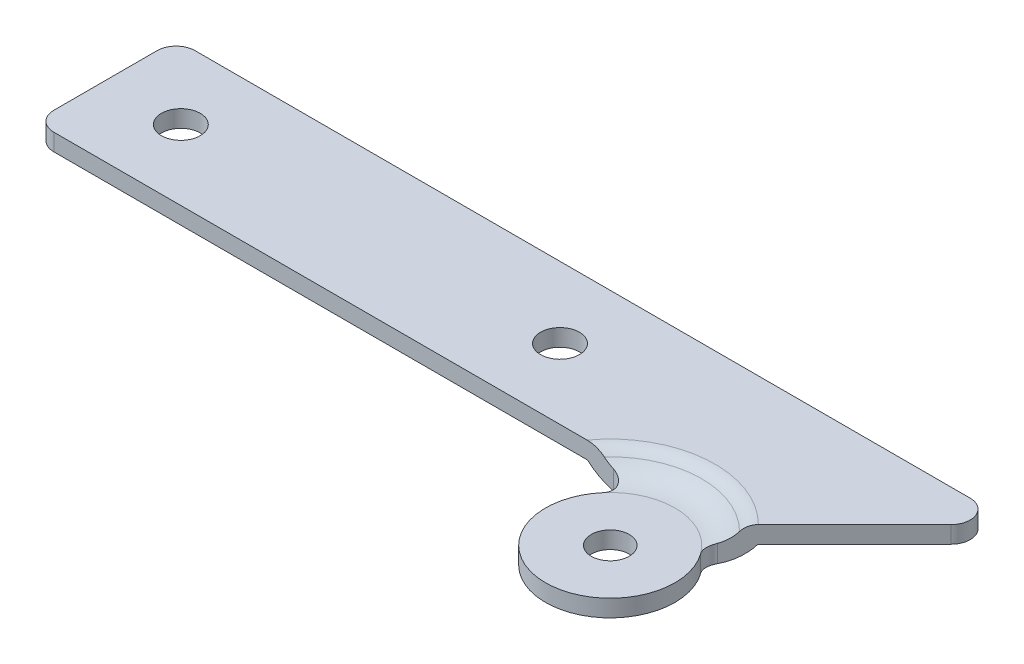
ISO-10303-21;
HEADER;
FILE_DESCRIPTION(('STEP AP214'),'2;1');
FILE_NAME('part.step','',(''),(''),'','','');
FILE_SCHEMA(('AUTOMOTIVE_DESIGN { 1 0 10303 214 1 1 1 1 }'));
ENDSEC;
DATA;
#1=APPLICATION_CONTEXT('core data for automotive mechanical design processes');
#2=APPLICATION_PROTOCOL_DEFINITION('international standard','automotive_design',2000,#1);
#3=PRODUCT_CONTEXT('',#1,'mechanical');
#4=PRODUCT('Part','Part','',(#3));
#5=PRODUCT_RELATED_PRODUCT_CATEGORY('part','',(#4));
#6=PRODUCT_DEFINITION_FORMATION('','',#4);
#7=PRODUCT_DEFINITION_CONTEXT('part definition',#1,'design');
#8=PRODUCT_DEFINITION('design','',#6,#7);
#9=PRODUCT_DEFINITION_SHAPE('','',#8);
#10=(LENGTH_UNIT() NAMED_UNIT(*) SI_UNIT(.MILLI.,.METRE.));
#11=(NAMED_UNIT(*) PLANE_ANGLE_UNIT() SI_UNIT($,.RADIAN.));
#12=(NAMED_UNIT(*) SI_UNIT($,.STERADIAN.) SOLID_ANGLE_UNIT());
#13=UNCERTAINTY_MEASURE_WITH_UNIT(LENGTH_MEASURE(1.E-05),#10,'distance_accuracy_value','');
#14=(GEOMETRIC_REPRESENTATION_CONTEXT(3) GLOBAL_UNCERTAINTY_ASSIGNED_CONTEXT((#13)) GLOBAL_UNIT_ASSIGNED_CONTEXT((#10,
#11,#12)) REPRESENTATION_CONTEXT('',''));
#15=CARTESIAN_POINT('',(0.,0.,0.));
#16=DIRECTION('',(0.,0.,1.));
#17=DIRECTION('',(1.,0.,0.));
#18=AXIS2_PLACEMENT_3D('',#15,#16,#17);
#19=CARTESIAN_POINT('',(44.4503952922486,-3.13962266922809,17.653));
#20=DIRECTION('',(0.,1.,0.));
#21=DIRECTION('',(0.,0.,1.));
#22=AXIS2_PLACEMENT_3D('',#19,#20,#21);
#23=CYLINDRICAL_SURFACE('',#22,2.54);
#24=CARTESIAN_POINT('',(44.4503952922486,-0.12700000003041,17.653));
#25=DIRECTION('',(0.,1.,0.));
#26=DIRECTION('',(0.,0.,1.));
#27=AXIS2_PLACEMENT_3D('',#24,#25,#26);
#28=CIRCLE('',#27,2.54);
#29=CARTESIAN_POINT('',(44.4503952922486,-0.12700000003041,20.193));
#30=VERTEX_POINT('',#29);
#31=EDGE_CURVE('E18',#30,#30,#28,.T.);
#32=ORIENTED_EDGE('',*,*,#31,.T.);
#33=EDGE_LOOP('',(#32));
#34=FACE_BOUND('',#33,.T.);
#35=CARTESIAN_POINT('',(44.4503952922486,-2.41300000003041,17.653));
#36=DIRECTION('',(0.,1.,0.));
#37=DIRECTION('',(0.,0.,1.));
#38=AXIS2_PLACEMENT_3D('',#35,#36,#37);
#39=CIRCLE('',#38,2.54);
#40=CARTESIAN_POINT('',(44.4503952922486,-2.41300000003041,20.193));
#41=VERTEX_POINT('',#40);
#42=EDGE_CURVE('E314',#41,#41,#39,.T.);
#43=ORIENTED_EDGE('',*,*,#42,.F.);
#44=EDGE_LOOP('',(#43));
#45=FACE_BOUND('',#44,.T.);
#46=ADVANCED_FACE('F15',(#34,#45),#23,.F.);
#47=CARTESIAN_POINT('',(44.4503952922486,-0.12700000003041,17.653));
#48=DIRECTION('',(0.,-1.,0.));
#49=DIRECTION('',(0.,0.,-1.));
#50=AXIS2_PLACEMENT_3D('',#47,#48,#49);
#51=PLANE('',#50);
#52=ORIENTED_EDGE('',*,*,#31,.F.);
#53=EDGE_LOOP('',(#52));
#54=FACE_BOUND('',#53,.T.);
#55=CARTESIAN_POINT('',(44.4503952922486,-0.12700000003041,17.653));
#56=DIRECTION('',(0.,-1.,0.));
#57=DIRECTION('',(-0.760302428804956,0.,-0.649569254778337));
#58=AXIS2_PLACEMENT_3D('',#55,#56,#57);
#59=CIRCLE('',#58,8.67699443373867);
#60=CARTESIAN_POINT('',(51.4610548897929,-0.12700000003041,12.54018429723));
#61=VERTEX_POINT('',#60);
#62=CARTESIAN_POINT('',(37.85325534955,-0.12700000003041,12.0166911919606));
#63=VERTEX_POINT('',#62);
#64=EDGE_CURVE('E128',#61,#63,#59,.F.);
#65=ORIENTED_EDGE('',*,*,#64,.T.);
#66=CARTESIAN_POINT('',(44.4503952922486,-0.12700000003041,17.653));
#67=DIRECTION('',(0.,1.,0.));
#68=DIRECTION('',(0.,0.,1.));
#69=AXIS2_PLACEMENT_3D('',#66,#67,#68);
#70=CIRCLE('',#69,8.67699443373867);
#71=EDGE_CURVE('E433',#61,#63,#70,.F.);
#72=ORIENTED_EDGE('',*,*,#71,.F.);
#73=EDGE_LOOP('',(#65,#72));
#74=FACE_BOUND('',#73,.T.);
#75=ADVANCED_FACE('F273',(#54,#74),#51,.F.);
#76=CARTESIAN_POINT('',(44.4503952922486,-2.41300000003041,17.653));
#77=DIRECTION('',(0.,1.,0.));
#78=DIRECTION('',(0.,0.,1.));
#79=AXIS2_PLACEMENT_3D('',#76,#77,#78);
#80=CYLINDRICAL_SURFACE('',#79,8.67699443373867);
#81=DIRECTION('',(0.,1.,0.));
#82=VECTOR('',#81,1.);
#83=CARTESIAN_POINT('',(51.4610548897929,-2.41300000003041,12.54018429723));
#84=LINE('',#83,#82);
#85=CARTESIAN_POINT('',(51.4610548897929,-2.41300000003041,12.54018429723));
#86=VERTEX_POINT('',#85);
#87=EDGE_CURVE('E135',#86,#61,#84,.T.);
#88=ORIENTED_EDGE('',*,*,#87,.T.);
#89=ORIENTED_EDGE('',*,*,#71,.T.);
#90=DIRECTION('',(0.,1.,0.));
#91=VECTOR('',#90,1.);
#92=CARTESIAN_POINT('',(37.85325534955,-2.41300000003041,12.0166911919606));
#93=LINE('',#92,#91);
#94=CARTESIAN_POINT('',(37.85325534955,-2.41300000003041,12.0166911919606));
#95=VERTEX_POINT('',#94);
#96=EDGE_CURVE('E311',#63,#95,#93,.F.);
#97=ORIENTED_EDGE('',*,*,#96,.T.);
#98=CARTESIAN_POINT('',(44.4503952922486,-2.41300000003041,17.653));
#99=DIRECTION('',(0.,1.,0.));
#100=DIRECTION('',(0.,0.,1.));
#101=AXIS2_PLACEMENT_3D('',#98,#99,#100);
#102=CIRCLE('',#101,8.67699443373867);
#103=EDGE_CURVE('E431',#86,#95,#102,.F.);
#104=ORIENTED_EDGE('',*,*,#103,.F.);
#105=EDGE_LOOP('',(#88,#89,#97,#104));
#106=FACE_BOUND('',#105,.T.);
#107=ADVANCED_FACE('F268',(#106),#80,.T.);
#108=CARTESIAN_POINT('',(44.4503952922486,-2.41300000003041,17.653));
#109=DIRECTION('',(0.,-1.,0.));
#110=DIRECTION('',(0.,0.,-1.));
#111=AXIS2_PLACEMENT_3D('',#108,#109,#110);
#112=PLANE('',#111);
#113=ORIENTED_EDGE('',*,*,#42,.T.);
#114=EDGE_LOOP('',(#113));
#115=FACE_BOUND('',#114,.T.);
#116=CARTESIAN_POINT('',(44.4503952922486,-2.41300000003041,17.653));
#117=DIRECTION('',(0.,1.,0.));
#118=DIRECTION('',(0.807959443915839,0.,-0.589238098723435));
#119=AXIS2_PLACEMENT_3D('',#116,#117,#118);
#120=CIRCLE('',#119,8.67699443373866);
#121=EDGE_CURVE('E251',#86,#95,#120,.T.);
#122=ORIENTED_EDGE('',*,*,#121,.F.);
#123=ORIENTED_EDGE('',*,*,#103,.T.);
#124=EDGE_LOOP('',(#122,#123));
#125=FACE_BOUND('',#124,.T.);
#126=ADVANCED_FACE('F257',(#115,#125),#112,.T.);
#127=CARTESIAN_POINT('',(36.6462752438221,-2.41300000003041,10.9855));
#128=DIRECTION('',(0.,1.,0.));
#129=DIRECTION('',(0.,0.,1.));
#130=AXIS2_PLACEMENT_3D('',#127,#128,#129);
#131=CYLINDRICAL_SURFACE('',#130,1.5875);
#132=ORIENTED_EDGE('',*,*,#96,.F.);
#133=CARTESIAN_POINT('',(37.85325534955,-0.12700000003041,12.0166911919606));
#134=CARTESIAN_POINT('',(37.8822032619722,-0.12699357584352,11.9828149944831));
#135=CARTESIAN_POINT('',(37.9097169934397,-0.126999840282788,11.9477161730048));
#136=CARTESIAN_POINT('',(37.9616976655333,-0.126990895706065,11.8753325807003));
#137=CARTESIAN_POINT('',(37.9861647247903,-0.126975687526456,11.8380478950704));
#138=CARTESIAN_POINT('',(38.0318705702176,-0.126876965328563,11.7615581238861));
#139=CARTESIAN_POINT('',(38.0531101087453,-0.12679346725818,11.7223534887115));
#140=CARTESIAN_POINT('',(38.0922153861983,-0.126467953073541,11.6423106593733));
#141=CARTESIAN_POINT('',(38.1100811666746,-0.126225938911719,11.6014724853357));
#142=CARTESIAN_POINT('',(38.1584340754211,-0.125094248648951,11.4768781556044));
#143=CARTESIAN_POINT('',(38.1836898184842,-0.123799017271902,11.3910203137122));
#144=CARTESIAN_POINT('',(38.2194195073506,-0.118970644195672,11.2164140567206));
#145=CARTESIAN_POINT('',(38.2298989666648,-0.11543833793504,11.1276667324337));
#146=CARTESIAN_POINT('',(38.2358406703157,-0.104909760431675,10.9505536318909));
#147=CARTESIAN_POINT('',(38.2314200980152,-0.0979408857131835,10.8621903255012));
#148=CARTESIAN_POINT('',(38.2081038047483,-0.0794855849199816,10.6878781780898));
#149=CARTESIAN_POINT('',(38.1892092882199,-0.067999534777181,10.6019291367839));
#150=CARTESIAN_POINT('',(38.1384394074222,-0.040153215046412,10.4369723447442));
#151=CARTESIAN_POINT('',(38.1068658984526,-0.0239085163032391,10.3578518776138));
#152=CARTESIAN_POINT('',(38.0321417817778,0.0137000461974292,10.2066252996822));
#153=CARTESIAN_POINT('',(37.9889911410483,0.0350639245575904,10.1345192088904));
#154=CARTESIAN_POINT('',(37.8922844507806,0.0828945993898807,9.9982402392753));
#155=CARTESIAN_POINT('',(37.8386137644128,0.10941758782603,9.93416882326385));
#156=CARTESIAN_POINT('',(37.7231010537479,0.16674133326273,9.81612898052181));
#157=CARTESIAN_POINT('',(37.6612569264516,0.197543191306813,9.76216316259424));
#158=CARTESIAN_POINT('',(37.5262537654841,0.26501869039011,9.66133032935777));
#159=CARTESIAN_POINT('',(37.4525914424129,0.301961029216738,9.61531911989643));
#160=CARTESIAN_POINT('',(37.2998739869073,0.37852289602598,9.53623530121435));
#161=CARTESIAN_POINT('',(37.2208149359553,0.418144369103684,9.50317221342322));
#162=CARTESIAN_POINT('',(37.0602108257916,0.498101359430003,9.45061998494698));
#163=CARTESIAN_POINT('',(36.9787180008281,0.538418362156986,9.43094212398631));
#164=CARTESIAN_POINT('',(36.8137075956259,0.618767714248563,9.40465519505122));
#165=CARTESIAN_POINT('',(36.7301940832984,0.658800454737621,9.39802177595316));
#166=CARTESIAN_POINT('',(36.6462752438221,0.697999556154315,9.39799999999998));
#167=B_SPLINE_CURVE_WITH_KNOTS('',3,(#133,#134,#135,#136,#137,#138,#139,#140,#141,#142,#143,
#144,#145,#146,#147,#148,#149,#150,#151,#152,#153,#154,#155,#156,#157,#158,#159,#160,#161,#162,
#163,#164,#165,#166),.UNSPECIFIED.,.F.,.F.,(4,2,2,2,2,2,2,2,2,2,2,2,2,2,2,2,4),(0.,
0.133636146836537,0.267267088533071,0.400866831984319,0.53446492992592,0.801585666559904,
1.06860670538079,1.33353263588604,1.59843652318217,1.85737584270882,2.1163159008791,
2.37825251779267,2.64025666181482,2.92225163565687,3.20445358748349,3.48258934043794,
3.76020537993433),.UNSPECIFIED.);
#168=CARTESIAN_POINT('',(36.6462752438221,0.697999556154314,9.39799999999999));
#169=VERTEX_POINT('',#168);
#170=EDGE_CURVE('E411',#63,#169,#167,.T.);
#171=ORIENTED_EDGE('',*,*,#170,.T.);
#172=DIRECTION('',(0.,1.,0.));
#173=VECTOR('',#172,1.);
#174=CARTESIAN_POINT('',(36.6462752438221,2.286,9.39799999999999));
#175=LINE('',#174,#173);
#176=CARTESIAN_POINT('',(36.6462752438221,-1.88342261208621,9.39799999999999));
#177=VERTEX_POINT('',#176);
#178=EDGE_CURVE('E191',#177,#169,#175,.T.);
#179=ORIENTED_EDGE('',*,*,#178,.F.);
#180=CARTESIAN_POINT('',(37.85325534955,-2.41300000003041,12.0166911919606));
#181=CARTESIAN_POINT('',(37.8822399801254,-2.41299656145982,11.9827650366654));
#182=CARTESIAN_POINT('',(37.9097798997594,-2.41300035391785,11.9476326896234));
#183=CARTESIAN_POINT('',(37.96180592947,-2.41299335372206,11.87517769664));
#184=CARTESIAN_POINT('',(37.9862921732067,-2.41298256170685,11.8378551466695));
#185=CARTESIAN_POINT('',(38.0548639607022,-2.41288483491481,11.7230369835564));
#186=CARTESIAN_POINT('',(38.0941438961141,-2.41273270090005,11.6425954690924));
#187=CARTESIAN_POINT('',(38.1586507183666,-2.41170395339247,11.4762632866642));
#188=CARTESIAN_POINT('',(38.183870193205,-2.41082695839116,11.3903697711881));
#189=CARTESIAN_POINT('',(38.2195374965038,-2.40755355376761,11.2156046156913));
#190=CARTESIAN_POINT('',(38.2299893395239,-2.40515755734045,11.1267337917753));
#191=CARTESIAN_POINT('',(38.2358361307235,-2.39800351885394,10.9489131377669));
#192=CARTESIAN_POINT('',(38.231285291383,-2.39325403393996,10.8599647507378));
#193=CARTESIAN_POINT('',(38.2074540726679,-2.38065918723953,10.6842794011772));
#194=CARTESIAN_POINT('',(38.1881732038192,-2.37281372257888,10.597542512232));
#195=CARTESIAN_POINT('',(38.1358828502528,-2.3536477433091,10.4297415081447));
#196=CARTESIAN_POINT('',(38.103020787721,-2.34236487683622,10.3486270799451));
#197=CARTESIAN_POINT('',(38.0247563161692,-2.31615995088939,10.1933470159968));
#198=CARTESIAN_POINT('',(37.97935429845,-2.30123800497215,10.119181163519));
#199=CARTESIAN_POINT('',(37.8772356197002,-2.26785424035333,9.97929991995353));
#200=CARTESIAN_POINT('',(37.8204520258506,-2.24937150758591,9.91363849131462));
#201=CARTESIAN_POINT('',(37.6975248365339,-2.20942785197899,9.7928301107711));
#202=CARTESIAN_POINT('',(37.6313793175245,-2.18796631711929,9.73768532514178));
#203=CARTESIAN_POINT('',(37.4889757435167,-2.14195097181251,9.63720877673361));
#204=CARTESIAN_POINT('',(37.4124314802008,-2.11731137977342,9.59232256416344));
#205=CARTESIAN_POINT('',(37.2533390009948,-2.06661146026913,9.51600528390614));
#206=CARTESIAN_POINT('',(37.1707903710161,-2.04055103484788,9.48457514524246));
#207=CARTESIAN_POINT('',(37.0149126795996,-1.99222809275234,9.43960843656497));
#208=CARTESIAN_POINT('',(36.9421471130521,-1.97000543455366,9.4240488670552));
#209=CARTESIAN_POINT('',(36.795083077898,-1.92611915795541,9.40324552473372));
#210=CARTESIAN_POINT('',(36.7207864028513,-1.90445494568515,9.39799030609377));
#211=CARTESIAN_POINT('',(36.6462752438221,-1.88342261208621,9.39799999999998));
#212=B_SPLINE_CURVE_WITH_KNOTS('',3,(#180,#181,#182,#183,#184,#185,#186,#187,#188,#189,#190,
#191,#192,#193,#194,#195,#196,#197,#198,#199,#200,#201,#202,#203,#204,#205,#206,#207,#208,#209,
#210,#211),.UNSPECIFIED.,.F.,.F.,(4,2,2,2,2,2,2,2,2,2,2,2,2,2,2,4),(0.,0.133782854775079,
0.267559851789285,0.534742553649619,0.802065968599256,1.06931669806774,1.3356027719386,
1.6018976947931,1.86537493105363,2.1288439466127,2.39391040206322,2.65903139850863,
2.93409470785859,3.20917700484736,3.44146576522841,3.67349635827377),.UNSPECIFIED.);
#213=EDGE_CURVE('E392',#95,#177,#212,.T.);
#214=ORIENTED_EDGE('',*,*,#213,.F.);
#215=EDGE_LOOP('',(#132,#171,#179,#214));
#216=FACE_BOUND('',#215,.T.);
#217=ADVANCED_FACE('F267',(#216),#131,.F.);
#218=CARTESIAN_POINT('',(44.4503952922486,4.64819999996959,17.653));
#219=DIRECTION('',(0.,1.,0.));
#220=DIRECTION('',(0.,0.,1.));
#221=AXIS2_PLACEMENT_3D('',#218,#219,#220);
#222=TOROIDAL_SURFACE('',#221,8.67699443373867,4.7752);
#223=CARTESIAN_POINT('',(44.4503952922486,1.48166666663626,17.653));
#224=DIRECTION('',(0.,1.,0.));
#225=DIRECTION('',(0.,0.,1.));
#226=AXIS2_PLACEMENT_3D('',#223,#224,#225);
#227=CIRCLE('',#226,12.2512918036967);
#228=CARTESIAN_POINT('',(35.3978196444384,1.48166666663626,9.39799999999999));
#229=VERTEX_POINT('',#228);
#230=CARTESIAN_POINT('',(53.1133668049377,1.48166666663626,8.99002848731088));
#231=VERTEX_POINT('',#230);
#232=EDGE_CURVE('E213',#229,#231,#227,.F.);
#233=ORIENTED_EDGE('',*,*,#232,.F.);
#234=CARTESIAN_POINT('',(36.6462752438221,0.697999556154315,9.39799999999998));
#235=CARTESIAN_POINT('',(36.5902691154025,0.724131846142782,9.39799999999999));
#236=CARTESIAN_POINT('',(36.5346331071177,0.75106198866906,9.39799999999999));
#237=CARTESIAN_POINT('',(36.4243419247119,0.806465591426125,9.39799999999999));
#238=CARTESIAN_POINT('',(36.3696843301863,0.834934235464384,9.39799999999999));
#239=CARTESIAN_POINT('',(36.2613709557785,0.893455789059646,9.39799999999999));
#240=CARTESIAN_POINT('',(36.2077133161656,0.92350525281748,9.39799999999999));
#241=CARTESIAN_POINT('',(36.1014240037671,0.985232372130987,9.39799999999999));
#242=CARTESIAN_POINT('',(36.0487912313239,1.01690813289203,9.39799999999999));
#243=CARTESIAN_POINT('',(35.9445605804883,1.08194764649301,9.39799999999999));
#244=CARTESIAN_POINT('',(35.8929629565739,1.1153118074722,9.39799999999999));
#245=CARTESIAN_POINT('',(35.7908560301176,1.18376895949815,9.39799999999999));
#246=CARTESIAN_POINT('',(35.7403478043849,1.21886355767911,9.39799999999999));
#247=CARTESIAN_POINT('',(35.640459396077,1.29083747221312,9.39799999999999));
#248=CARTESIAN_POINT('',(35.5910817612592,1.32772032800084,9.39799999999999));
#249=CARTESIAN_POINT('',(35.4934995257495,1.40333131706467,9.39799999999999));
#250=CARTESIAN_POINT('',(35.4452993329232,1.44206513717306,9.39799999999999));
#251=CARTESIAN_POINT('',(35.3978196444384,1.48166666663626,9.39799999999999));
#252=B_SPLINE_CURVE_WITH_KNOTS('',3,(#234,#235,#236,#237,#238,#239,#240,#241,#242,#243,#244,
#245,#246,#247,#248,#249,#250,#251),.UNSPECIFIED.,.F.,.F.,(4,2,2,2,2,2,2,2,4),(0.,
0.185404947511082,0.370259787606954,0.554727160050264,0.738984282775716,0.923286160990438,
1.10776255686209,1.29262030634037,1.47808797916946),.UNSPECIFIED.);
#253=EDGE_CURVE('E194',#169,#229,#252,.T.);
#254=ORIENTED_EDGE('',*,*,#253,.F.);
#255=ORIENTED_EDGE('',*,*,#170,.F.);
#256=ORIENTED_EDGE('',*,*,#64,.F.);
#257=CARTESIAN_POINT('',(51.4610548897929,-0.12700000003041,12.54018429723));
#258=CARTESIAN_POINT('',(51.4347952435241,-0.126993576169972,12.5041844237733));
#259=CARTESIAN_POINT('',(51.4100594557561,-0.126999840389627,12.4670757328376));
#260=CARTESIAN_POINT('',(51.3637935731327,-0.126990895771473,12.3909129511888));
#261=CARTESIAN_POINT('',(51.3422633536243,-0.126975687768884,12.3518589362012));
#262=CARTESIAN_POINT('',(51.3025689666508,-0.126876967346128,12.2720838432183));
#263=CARTESIAN_POINT('',(51.2844040455595,-0.126793470241382,12.2313631409614));
#264=CARTESIAN_POINT('',(51.2515635702301,-0.12646795458767,12.148552186645));
#265=CARTESIAN_POINT('',(51.236887972795,-0.126225938001275,12.1064619515473));
#266=CARTESIAN_POINT('',(51.1982494269307,-0.125094236049684,11.9785188763009));
#267=CARTESIAN_POINT('',(51.179664163295,-0.123798984730494,11.890972393628));
#268=CARTESIAN_POINT('',(51.1574552766642,-0.118970447290142,11.7141369859358));
#269=CARTESIAN_POINT('',(51.1538253635298,-0.115438102799588,11.6248488093434));
#270=CARTESIAN_POINT('',(51.1615071822012,-0.104910519918037,11.4478162466703));
#271=CARTESIAN_POINT('',(51.1727004199007,-0.0979430199973769,11.3600652312143));
#272=CARTESIAN_POINT('',(51.2093376710495,-0.079488046182522,11.1880570011627));
#273=CARTESIAN_POINT('',(51.2347840348522,-0.067999826910597,11.1038003652552));
#274=CARTESIAN_POINT('',(51.2980937114425,-0.0401463988706432,10.9431802392321));
#275=CARTESIAN_POINT('',(51.3356708284695,-0.0238943252310592,10.8666836617983));
#276=CARTESIAN_POINT('',(51.4218273784822,0.0137310345407412,10.7216306995218));
#277=CARTESIAN_POINT('',(51.4703936250435,0.0350981845956175,10.6530649458814));
#278=CARTESIAN_POINT('',(51.5390102706255,0.0658000581678463,10.5706039560829));
#279=CARTESIAN_POINT('',(51.5549481803034,0.0729625340841673,10.5523264539436));
#280=CARTESIAN_POINT('',(51.5875287303717,0.0876713433967778,10.5166388806914));
#281=CARTESIAN_POINT('',(51.6041700151685,0.0952169435970285,10.4992272702198));
#282=CARTESIAN_POINT('',(51.6211584918745,0.102955193081931,10.482236800372));
#283=B_SPLINE_CURVE_WITH_KNOTS('',3,(#257,#258,#259,#260,#261,#262,#263,#264,#265,#266,#267,
#268,#269,#270,#271,#272,#273,#274,#275,#276,#277,#278,#279,#280,#281,#282),.UNSPECIFIED.,.F.,
.F.,(4,2,2,2,2,2,2,2,2,2,2,2,4),(0.,0.133635525210901,0.267265852455416,0.400866218203313,
0.534464929925057,0.801591999641598,1.06860670568735,1.33349976697926,1.5984365222408,
1.85753083598403,2.11631588249819,2.19215663343425,2.26785734769636),.UNSPECIFIED.);
#284=CARTESIAN_POINT('',(51.6211584918751,0.102955193081953,10.4822368003724));
#285=VERTEX_POINT('',#284);
#286=EDGE_CURVE('E124',#61,#285,#283,.T.);
#287=ORIENTED_EDGE('',*,*,#286,.T.);
#288=CARTESIAN_POINT('',(53.1133668049377,1.48166666663626,8.99002848731088));
#289=CARTESIAN_POINT('',(53.0497322459138,1.38006256996459,9.05366304633481));
#290=CARTESIAN_POINT('',(52.983019935166,1.28231635857511,9.12037535708255));
#291=CARTESIAN_POINT('',(52.8439397243861,1.09517938502789,9.25945556786241));
#292=CARTESIAN_POINT('',(52.7715703784005,1.00579077200134,9.33182491384807));
#293=CARTESIAN_POINT('',(52.623353614427,0.837923915497622,9.4800416778216));
#294=CARTESIAN_POINT('',(52.5476173819415,0.759249284267575,9.55577791030706));
#295=CARTESIAN_POINT('',(52.3918064495921,0.611125458109484,9.71158884265645));
#296=CARTESIAN_POINT('',(52.3117333955879,0.541672797430706,9.79166189666064));
#297=CARTESIAN_POINT('',(52.1336200102782,0.40129417684349,9.96977528197036));
#298=CARTESIAN_POINT('',(52.0348626495808,0.332179913405813,10.0685326426677));
#299=CARTESIAN_POINT('',(51.8317276911468,0.207075407463629,10.2716676011018));
#300=CARTESIAN_POINT('',(51.7272932743001,0.151269649615786,10.3761020179485));
#301=CARTESIAN_POINT('',(51.6211584918757,0.102955193081979,10.4822368003729));
#302=B_SPLINE_CURVE_WITH_KNOTS('',3,(#288,#289,#290,#291,#292,#293,#294,#295,#296,#297,#298,
#299,#300,#301),.UNSPECIFIED.,.F.,.F.,(4,2,2,2,2,2,4),(0.,0.407058804524099,0.814221996750503,
1.21244954215881,1.61052700169594,2.07725848029542,2.55012599001393),.UNSPECIFIED.);
#303=EDGE_CURVE('E111',#231,#285,#302,.T.);
#304=ORIENTED_EDGE('',*,*,#303,.F.);
#305=EDGE_LOOP('',(#233,#254,#255,#256,#287,#304));
#306=FACE_BOUND('',#305,.T.);
#307=ADVANCED_FACE('F125',(#306),#222,.F.);
#308=CARTESIAN_POINT('',(52.7436905070093,-2.41300000003041,11.6047688155066));
#309=DIRECTION('',(0.,1.,0.));
#310=DIRECTION('',(0.,0.,1.));
#311=AXIS2_PLACEMENT_3D('',#308,#309,#310);
#312=CYLINDRICAL_SURFACE('',#311,1.5875);
#313=DIRECTION('',(0.,1.,0.));
#314=VECTOR('',#313,1.);
#315=CARTESIAN_POINT('',(51.6211584918757,2.286,10.4822368003729));
#316=LINE('',#315,#314);
#317=CARTESIAN_POINT('',(51.6211584918757,-2.2595681457153,10.4822368003729));
#318=VERTEX_POINT('',#317);
#319=EDGE_CURVE('E115',#285,#318,#316,.F.);
#320=ORIENTED_EDGE('',*,*,#319,.F.);
#321=ORIENTED_EDGE('',*,*,#286,.F.);
#322=ORIENTED_EDGE('',*,*,#87,.F.);
#323=CARTESIAN_POINT('',(51.6211584918757,-2.2595681457153,10.4822368003729));
#324=CARTESIAN_POINT('',(51.590473619888,-2.26876697908094,10.5129219730938));
#325=CARTESIAN_POINT('',(51.5609983477627,-2.27754895503426,10.5449152356508));
#326=CARTESIAN_POINT('',(51.5046702811015,-2.29424437852611,10.6113483941292));
#327=CARTESIAN_POINT('',(51.4778177321217,-2.30215774474841,10.645788518621));
#328=CARTESIAN_POINT('',(51.4015779054809,-2.32451956228859,10.7524172687029));
#329=CARTESIAN_POINT('',(51.3564223107895,-2.33761541005459,10.8280002430247));
#330=CARTESIAN_POINT('',(51.2790519676684,-2.36014179061674,10.9860973119358));
#331=CARTESIAN_POINT('',(51.2468526373931,-2.36956795600374,11.0686195240354));
#332=CARTESIAN_POINT('',(51.1965846773915,-2.3850724631475,11.2381270113683));
#333=CARTESIAN_POINT('',(51.1785091938078,-2.39115242828565,11.3251101000135));
#334=CARTESIAN_POINT('',(51.1572185821755,-2.40055201739991,11.5001000445791));
#335=CARTESIAN_POINT('',(51.153852626479,-2.40389937032047,11.5880871891045));
#336=CARTESIAN_POINT('',(51.1617084664939,-2.40872871924282,11.7635186965492));
#337=CARTESIAN_POINT('',(51.1729400383739,-2.41020946384211,11.8509626562682));
#338=CARTESIAN_POINT('',(51.2098634905342,-2.41211759678412,12.0235745277887));
#339=CARTESIAN_POINT('',(51.235686899425,-2.41253521103583,12.1087142499874));
#340=CARTESIAN_POINT('',(51.3011535082902,-2.41297114569377,12.2733996922009));
#341=CARTESIAN_POINT('',(51.3407716375562,-2.41299018666137,12.3529552479044));
#342=CARTESIAN_POINT('',(51.3982751203639,-2.41299849800293,12.4476911652213));
#343=CARTESIAN_POINT('',(51.4102926338021,-2.41299938180028,12.4665744242925));
#344=CARTESIAN_POINT('',(51.4350975658723,-2.41300022059359,12.5037895874197));
#345=CARTESIAN_POINT('',(51.4478838659454,-2.41300017690788,12.5221222369806));
#346=CARTESIAN_POINT('',(51.4610548897927,-2.41300000003041,12.5401842972301));
#347=B_SPLINE_CURVE_WITH_KNOTS('',3,(#323,#324,#325,#326,#327,#328,#329,#330,#331,#332,#333,
#334,#335,#336,#337,#338,#339,#340,#341,#342,#343,#344,#345,#346),.UNSPECIFIED.,.F.,.F.,(4,2,2,
2,2,2,2,2,2,2,2,4),(0.,0.133002458630632,0.26601735789049,0.531678698952267,0.797655252717396,
1.06350265615487,1.32661763670419,1.5899089198722,1.85561222044711,2.12083512729617,
2.18797227958885,2.25501400848879),.UNSPECIFIED.);
#348=EDGE_CURVE('E134',#318,#86,#347,.T.);
#349=ORIENTED_EDGE('',*,*,#348,.F.);
#350=EDGE_LOOP('',(#320,#321,#322,#349));
#351=FACE_BOUND('',#350,.T.);
#352=ADVANCED_FACE('F137',(#351),#312,.F.);
#353=CARTESIAN_POINT('',(44.4503952922486,4.64819999996959,17.653));
#354=DIRECTION('',(0.,1.,0.));
#355=DIRECTION('',(0.,0.,1.));
#356=AXIS2_PLACEMENT_3D('',#353,#354,#355);
#357=TOROIDAL_SURFACE('',#356,8.67699443373867,7.0612);
#358=ORIENTED_EDGE('',*,*,#213,.T.);
#359=CARTESIAN_POINT('',(33.1896957390191,-0.0342269503850164,9.398));
#360=CARTESIAN_POINT('',(33.309184548041,-0.143019797463722,9.39799999999999));
#361=CARTESIAN_POINT('',(33.4323359881504,-0.247746106593866,9.39799999999999));
#362=CARTESIAN_POINT('',(33.6850299171103,-0.448839717821115,9.39799999999999));
#363=CARTESIAN_POINT('',(33.8145639502821,-0.545217636345454,9.39799999999999));
#364=CARTESIAN_POINT('',(34.0793623331157,-0.729642735477888,9.39799999999999));
#365=CARTESIAN_POINT('',(34.2146249833065,-0.817692362067445,9.39799999999999));
#366=CARTESIAN_POINT('',(34.4877291969917,-0.984025218323826,9.39799999999999));
#367=CARTESIAN_POINT('',(34.6254821375913,-1.06245426802723,9.39799999999999));
#368=CARTESIAN_POINT('',(34.9052000583578,-1.21144169194825,9.39799999999999));
#369=CARTESIAN_POINT('',(35.0471657040402,-1.28199881410246,9.39799999999999));
#370=CARTESIAN_POINT('',(35.3346214859613,-1.4153843694714,9.39799999999999));
#371=CARTESIAN_POINT('',(35.4801105492538,-1.47821512095203,9.39799999999999));
#372=CARTESIAN_POINT('',(35.7930413014898,-1.60403701838155,9.39799999999999));
#373=CARTESIAN_POINT('',(35.9608940437835,-1.66600354427327,9.39799999999999));
#374=CARTESIAN_POINT('',(36.3008479467168,-1.78128114646283,9.39799999999999));
#375=CARTESIAN_POINT('',(36.472970464693,-1.83452937873956,9.39799999999999));
#376=CARTESIAN_POINT('',(36.6462752438221,-1.8834226120862,9.39799999999999));
#377=B_SPLINE_CURVE_WITH_KNOTS('',3,(#359,#360,#361,#362,#363,#364,#365,#366,#367,#368,#369,
#370,#371,#372,#373,#374,#375,#376),.UNSPECIFIED.,.F.,.F.,(4,2,2,2,2,2,2,2,4),(0.,
0.484654534646943,0.968683410578138,1.45256968513056,1.92785184280186,2.40320948866393,
2.87842415558414,3.41493394637438,3.95515531087969),.UNSPECIFIED.);
#378=CARTESIAN_POINT('',(33.1896957390191,-0.0342269503850147,9.39799999999999));
#379=VERTEX_POINT('',#378);
#380=EDGE_CURVE('E195',#379,#177,#377,.T.);
#381=ORIENTED_EDGE('',*,*,#380,.F.);
#382=CARTESIAN_POINT('',(44.4503952922486,-0.0342269503850148,17.653));
#383=DIRECTION('',(0.,1.,0.));
#384=DIRECTION('',(0.,0.,1.));
#385=AXIS2_PLACEMENT_3D('',#382,#383,#384);
#386=CIRCLE('',#385,13.9623916084638);
#387=CARTESIAN_POINT('',(54.3232970801755,-0.0342269503850164,7.78009821207306));
#388=VERTEX_POINT('',#387);
#389=EDGE_CURVE('E121',#379,#388,#386,.F.);
#390=ORIENTED_EDGE('',*,*,#389,.T.);
#391=CARTESIAN_POINT('',(51.6211584918757,-2.2595681457153,10.4822368003729));
#392=CARTESIAN_POINT('',(51.7603045683477,-2.21788674236586,10.3430907239009));
#393=CARTESIAN_POINT('',(51.8981838577658,-2.16775303561884,10.2052114344828));
#394=CARTESIAN_POINT('',(52.1704197812672,-2.05104424876379,9.9329755109814));
#395=CARTESIAN_POINT('',(52.3047763870229,-1.9844690364869,9.79861890522568));
#396=CARTESIAN_POINT('',(52.5655308538123,-1.83728554838523,9.53786443843621));
#397=CARTESIAN_POINT('',(52.6920448910463,-1.75708848162003,9.41135040120231));
#398=CARTESIAN_POINT('',(52.9399093043177,-1.58210651779362,9.16348598793087));
#399=CARTESIAN_POINT('',(53.0612603380869,-1.48732348603135,9.04213495416165));
#400=CARTESIAN_POINT('',(53.284879545404,-1.29507683956904,8.81851574684457));
#401=CARTESIAN_POINT('',(53.3877745398704,-1.19906708567755,8.71562075237821));
#402=CARTESIAN_POINT('',(53.5882639786792,-0.996549887399507,8.51513131356939));
#403=CARTESIAN_POINT('',(53.6858584926346,-0.89004258093248,8.41753679961399));
#404=CARTESIAN_POINT('',(53.8774625710033,-0.664457128941352,8.22593272124522));
#405=CARTESIAN_POINT('',(53.9713316036532,-0.545140192599588,8.13206368859531));
#406=CARTESIAN_POINT('',(54.1524306431355,-0.296792408721661,7.95096464911301));
#407=CARTESIAN_POINT('',(54.2396598260079,-0.167760359545339,7.86373546624067));
#408=CARTESIAN_POINT('',(54.3232970801755,-0.0342269503850207,7.78009821207306));
#409=B_SPLINE_CURVE_WITH_KNOTS('',3,(#391,#392,#393,#394,#395,#396,#397,#398,#399,#400,#401,
#402,#403,#404,#405,#406,#407,#408),.UNSPECIFIED.,.F.,.F.,(4,2,2,2,2,2,2,2,4),(0.,
0.603261737167172,1.20652832395202,1.79406362940766,2.38152386134998,2.90406148649677,
3.42659224732593,3.96155470220782,4.4965834344205),.UNSPECIFIED.);
#410=EDGE_CURVE('E140',#318,#388,#409,.T.);
#411=ORIENTED_EDGE('',*,*,#410,.F.);
#412=ORIENTED_EDGE('',*,*,#348,.T.);
#413=ORIENTED_EDGE('',*,*,#121,.T.);
#414=EDGE_LOOP('',(#358,#381,#390,#411,#412,#413));
#415=FACE_BOUND('',#414,.T.);
#416=ADVANCED_FACE('F400',(#415),#357,.T.);
#417=CARTESIAN_POINT('',(44.4503952922486,2.286,17.653));
#418=DIRECTION('',(0.,1.,0.));
#419=DIRECTION('',(0.,0.,1.));
#420=AXIS2_PLACEMENT_3D('',#417,#418,#419);
#421=PLANE('',#420);
#422=CARTESIAN_POINT('',(-30.734,2.286,0.));
#423=DIRECTION('',(0.,1.,0.));
#424=DIRECTION('',(0.,0.,1.));
#425=AXIS2_PLACEMENT_3D('',#422,#423,#424);
#426=CIRCLE('',#425,2.6035);
#427=CARTESIAN_POINT('',(-30.734,2.286,2.6035));
#428=VERTEX_POINT('',#427);
#429=EDGE_CURVE('E385',#428,#428,#426,.F.);
#430=ORIENTED_EDGE('',*,*,#429,.T.);
#431=EDGE_LOOP('',(#430));
#432=FACE_BOUND('',#431,.T.);
#433=CARTESIAN_POINT('',(20.066,2.286,0.));
#434=DIRECTION('',(0.,1.,0.));
#435=DIRECTION('',(0.,0.,1.));
#436=AXIS2_PLACEMENT_3D('',#433,#434,#435);
#437=CIRCLE('',#436,2.6035);
#438=CARTESIAN_POINT('',(20.066,2.286,2.6035));
#439=VERTEX_POINT('',#438);
#440=EDGE_CURVE('E383',#439,#439,#437,.F.);
#441=ORIENTED_EDGE('',*,*,#440,.T.);
#442=EDGE_LOOP('',(#441));
#443=FACE_BOUND('',#442,.T.);
#444=CARTESIAN_POINT('',(-38.3536047077515,2.286,6.858));
#445=DIRECTION('',(0.,1.,0.));
#446=DIRECTION('',(0.,0.,1.));
#447=AXIS2_PLACEMENT_3D('',#444,#445,#446);
#448=CIRCLE('',#447,2.54);
#449=CARTESIAN_POINT('',(-38.3536047077515,2.286,9.398));
#450=VERTEX_POINT('',#449);
#451=CARTESIAN_POINT('',(-40.8936047077515,2.286,6.858));
#452=VERTEX_POINT('',#451);
#453=EDGE_CURVE('E200',#450,#452,#448,.F.);
#454=ORIENTED_EDGE('',*,*,#453,.F.);
#455=DIRECTION('',(1.,0.,0.));
#456=VECTOR('',#455,1.);
#457=CARTESIAN_POINT('',(41.1508385038299,2.286,9.39799999999999));
#458=LINE('',#457,#456);
#459=CARTESIAN_POINT('',(33.0955379019469,2.28599999998784,9.39799999999999));
#460=VERTEX_POINT('',#459);
#461=EDGE_CURVE('E180',#460,#450,#458,.F.);
#462=ORIENTED_EDGE('',*,*,#461,.F.);
#463=CARTESIAN_POINT('',(44.4503952922486,2.28599999996959,17.653));
#464=DIRECTION('',(0.,1.,0.));
#465=DIRECTION('',(0.707106781186546,0.,-0.707106781186549));
#466=AXIS2_PLACEMENT_3D('',#463,#464,#465);
#467=CIRCLE('',#466,14.0384404886757);
#468=CARTESIAN_POINT('',(54.377071759075,2.28599999998784,7.7263235331736));
#469=VERTEX_POINT('',#468);
#470=EDGE_CURVE('E386',#469,#460,#467,.T.);
#471=ORIENTED_EDGE('',*,*,#470,.F.);
#472=DIRECTION('',(0.707106781186546,0.,-0.707106781186549));
#473=VECTOR('',#472,1.);
#474=CARTESIAN_POINT('',(50.736574576997,2.286,11.3668207152516));
#475=LINE('',#474,#473);
#476=CARTESIAN_POINT('',(67.2923440680347,2.286,-5.18894877578618));
#477=VERTEX_POINT('',#476);
#478=EDGE_CURVE('E150',#477,#469,#475,.F.);
#479=ORIENTED_EDGE('',*,*,#478,.F.);
#480=CARTESIAN_POINT('',(65.4962928438208,2.286,-6.985));
#481=DIRECTION('',(0.,1.,0.));
#482=DIRECTION('',(0.,0.,1.));
#483=AXIS2_PLACEMENT_3D('',#480,#481,#482);
#484=CIRCLE('',#483,2.54);
#485=CARTESIAN_POINT('',(65.4962928438208,2.286,-9.525));
#486=VERTEX_POINT('',#485);
#487=EDGE_CURVE('E210',#486,#477,#484,.F.);
#488=ORIENTED_EDGE('',*,*,#487,.F.);
#489=DIRECTION('',(-1.,0.,0.));
#490=VECTOR('',#489,1.);
#491=CARTESIAN_POINT('',(-40.8936047077515,2.286,-9.525));
#492=LINE('',#491,#490);
#493=CARTESIAN_POINT('',(-38.3536047077515,2.286,-9.525));
#494=VERTEX_POINT('',#493);
#495=EDGE_CURVE('E207',#494,#486,#492,.F.);
#496=ORIENTED_EDGE('',*,*,#495,.F.);
#497=CARTESIAN_POINT('',(-38.3536047077515,2.286,-6.985));
#498=DIRECTION('',(0.,1.,0.));
#499=DIRECTION('',(0.,0.,1.));
#500=AXIS2_PLACEMENT_3D('',#497,#498,#499);
#501=CIRCLE('',#500,2.54);
#502=CARTESIAN_POINT('',(-40.8936047077515,2.286,-6.985));
#503=VERTEX_POINT('',#502);
#504=EDGE_CURVE('E204',#503,#494,#501,.F.);
#505=ORIENTED_EDGE('',*,*,#504,.F.);
#506=DIRECTION('',(0.,0.,1.));
#507=VECTOR('',#506,1.);
#508=CARTESIAN_POINT('',(-40.8936047077515,2.286,9.398));
#509=LINE('',#508,#507);
#510=EDGE_CURVE('E201',#452,#503,#509,.F.);
#511=ORIENTED_EDGE('',*,*,#510,.F.);
#512=EDGE_LOOP('',(#454,#462,#471,#479,#488,#496,#505,#511));
#513=FACE_BOUND('',#512,.T.);
#514=ADVANCED_FACE('F222',(#432,#443,#513),#421,.T.);
#515=CARTESIAN_POINT('',(44.4503952922486,-0.10160000003041,17.653));
#516=DIRECTION('',(0.,1.,0.));
#517=DIRECTION('',(0.,0.,1.));
#518=AXIS2_PLACEMENT_3D('',#515,#516,#517);
#519=TOROIDAL_SURFACE('',#518,14.0384404886757,2.3876);
#520=ORIENTED_EDGE('',*,*,#470,.T.);
#521=CARTESIAN_POINT('',(35.3978196444384,1.48166666663626,9.39799999999999));
#522=CARTESIAN_POINT('',(35.318459490364,1.54781254818349,9.39799999999999));
#523=CARTESIAN_POINT('',(35.2357608541375,1.60982719854078,9.39799999999999));
#524=CARTESIAN_POINT('',(35.0649164532028,1.72561433893596,9.39799999999999));
#525=CARTESIAN_POINT('',(34.9767774672605,1.77939680668766,9.39799999999999));
#526=CARTESIAN_POINT('',(34.7985543490562,1.87754002429786,9.39799999999999));
#527=CARTESIAN_POINT('',(34.7085893895245,1.92211826885084,9.39799999999999));
#528=CARTESIAN_POINT('',(34.5252847288344,2.00368333567142,9.39799999999999));
#529=CARTESIAN_POINT('',(34.4319438150998,2.04066739776254,9.39799999999998));
#530=CARTESIAN_POINT('',(34.1411229712526,2.14255539578408,9.39799999999998));
#531=CARTESIAN_POINT('',(33.9390615954929,2.19500056907658,9.39799999999999));
#532=CARTESIAN_POINT('',(33.6288845458628,2.24889657113773,9.39799999999999));
#533=CARTESIAN_POINT('',(33.5227257818189,2.26274322949401,9.39799999999999));
#534=CARTESIAN_POINT('',(33.3095865893164,2.28128732758038,9.39799999999999));
#535=CARTESIAN_POINT('',(33.202605955869,2.28598240510563,9.39799999999999));
#536=CARTESIAN_POINT('',(33.0955379019469,2.28599999996959,9.39799999999999));
#537=B_SPLINE_CURVE_WITH_KNOTS('',3,(#521,#522,#523,#524,#525,#526,#527,#528,#529,#530,#531,
#532,#533,#534,#535,#536),.UNSPECIFIED.,.F.,.F.,(4,2,2,2,2,2,2,4),(0.,0.309680460000033,
0.618982551743188,0.91982326427694,1.22077312738179,1.84368043914905,2.16453455196528,
2.48547147264133),.UNSPECIFIED.);
#538=EDGE_CURVE('E188',#229,#460,#537,.T.);
#539=ORIENTED_EDGE('',*,*,#538,.F.);
#540=ORIENTED_EDGE('',*,*,#232,.T.);
#541=CARTESIAN_POINT('',(54.377071759075,2.28599999996959,7.7263235331736));
#542=CARTESIAN_POINT('',(54.3296044364467,2.28600651262537,7.77379085580185));
#543=CARTESIAN_POINT('',(54.2821391848628,2.2831689999296,7.82125610738573));
#544=CARTESIAN_POINT('',(54.1875468070952,2.27185576056228,7.91584848515334));
#545=CARTESIAN_POINT('',(54.1404196734232,2.26338015915022,7.9629756188254));
#546=CARTESIAN_POINT('',(54.046835545991,2.24084061585375,8.05655974625754));
#547=CARTESIAN_POINT('',(54.0003785497991,2.22677669425396,8.10301674244947));
#548=CARTESIAN_POINT('',(53.9084796949122,2.19317381725238,8.19491559733638));
#549=CARTESIAN_POINT('',(53.8630377965392,2.17363507625558,8.2403574957094));
#550=CARTESIAN_POINT('',(53.7286553238736,2.10696115624211,8.37473996837495));
#551=CARTESIAN_POINT('',(53.6416430721546,2.05176467092183,8.461752220094));
#552=CARTESIAN_POINT('',(53.4755434039454,1.92155042580137,8.62785188830315));
#553=CARTESIAN_POINT('',(53.3964451368599,1.84656033251368,8.70695015538868));
#554=CARTESIAN_POINT('',(53.2847844714534,1.72024153702156,8.81861082079515));
#555=CARTESIAN_POINT('',(53.2484664620983,1.67541292772542,8.85492883015029));
#556=CARTESIAN_POINT('',(53.1787143665815,1.58159289498428,8.92468092566705));
#557=CARTESIAN_POINT('',(53.1452766797145,1.53260682556238,8.95811861253401));
#558=CARTESIAN_POINT('',(53.1133668049377,1.48166666663626,8.99002848731088));
#559=B_SPLINE_CURVE_WITH_KNOTS('',3,(#541,#542,#543,#544,#545,#546,#547,#548,#549,#550,#551,
#552,#553,#554,#555,#556,#557,#558),.UNSPECIFIED.,.F.,.F.,(4,2,2,2,2,2,2,2,4),(0.,
0.20132158788926,0.402638703234362,0.60395508784018,0.805263589591327,1.20781727411282,
1.6098112418259,1.81411165236281,2.01815284286006),.UNSPECIFIED.);
#560=EDGE_CURVE('E118',#469,#231,#559,.T.);
#561=ORIENTED_EDGE('',*,*,#560,.F.);
#562=EDGE_LOOP('',(#520,#539,#540,#561));
#563=FACE_BOUND('',#562,.T.);
#564=ADVANCED_FACE('F216',(#563),#519,.T.);
#565=CARTESIAN_POINT('',(20.066,2.286,0.));
#566=DIRECTION('',(0.,1.,0.));
#567=DIRECTION('',(0.,0.,1.));
#568=AXIS2_PLACEMENT_3D('',#565,#566,#567);
#569=CYLINDRICAL_SURFACE('',#568,2.6035);
#570=CARTESIAN_POINT('',(20.066,0.,0.));
#571=DIRECTION('',(0.,1.,0.));
#572=DIRECTION('',(0.,0.,1.));
#573=AXIS2_PLACEMENT_3D('',#570,#571,#572);
#574=CIRCLE('',#573,2.6035);
#575=CARTESIAN_POINT('',(20.066,0.,2.6035));
#576=VERTEX_POINT('',#575);
#577=EDGE_CURVE('E339',#576,#576,#574,.F.);
#578=ORIENTED_EDGE('',*,*,#577,.T.);
#579=EDGE_LOOP('',(#578));
#580=FACE_BOUND('',#579,.T.);
#581=ORIENTED_EDGE('',*,*,#440,.F.);
#582=EDGE_LOOP('',(#581));
#583=FACE_BOUND('',#582,.T.);
#584=ADVANCED_FACE('F221',(#580,#583),#569,.F.);
#585=CARTESIAN_POINT('',(-30.734,2.286,0.));
#586=DIRECTION('',(0.,1.,0.));
#587=DIRECTION('',(0.,0.,1.));
#588=AXIS2_PLACEMENT_3D('',#585,#586,#587);
#589=CYLINDRICAL_SURFACE('',#588,2.6035);
#590=CARTESIAN_POINT('',(-30.734,0.,0.));
#591=DIRECTION('',(0.,1.,0.));
#592=DIRECTION('',(0.,0.,1.));
#593=AXIS2_PLACEMENT_3D('',#590,#591,#592);
#594=CIRCLE('',#593,2.6035);
#595=CARTESIAN_POINT('',(-30.734,0.,2.6035));
#596=VERTEX_POINT('',#595);
#597=EDGE_CURVE('E334',#596,#596,#594,.F.);
#598=ORIENTED_EDGE('',*,*,#597,.T.);
#599=EDGE_LOOP('',(#598));
#600=FACE_BOUND('',#599,.T.);
#601=ORIENTED_EDGE('',*,*,#429,.F.);
#602=EDGE_LOOP('',(#601));
#603=FACE_BOUND('',#602,.T.);
#604=ADVANCED_FACE('F380',(#600,#603),#589,.F.);
#605=CARTESIAN_POINT('',(65.4962928438208,2.286,-6.985));
#606=DIRECTION('',(0.,1.,0.));
#607=DIRECTION('',(0.,0.,1.));
#608=AXIS2_PLACEMENT_3D('',#605,#606,#607);
#609=CYLINDRICAL_SURFACE('',#608,2.54);
#610=ORIENTED_EDGE('',*,*,#487,.T.);
#611=DIRECTION('',(0.,1.,0.));
#612=VECTOR('',#611,1.);
#613=CARTESIAN_POINT('',(67.2923440680347,2.286,-5.18894877578618));
#614=LINE('',#613,#612);
#615=CARTESIAN_POINT('',(67.2923440680347,0.,-5.18894877578618));
#616=VERTEX_POINT('',#615);
#617=EDGE_CURVE('E147',#616,#477,#614,.T.);
#618=ORIENTED_EDGE('',*,*,#617,.F.);
#619=CARTESIAN_POINT('',(65.4962928438208,0.,-6.985));
#620=DIRECTION('',(0.,1.,0.));
#621=DIRECTION('',(0.,0.,1.));
#622=AXIS2_PLACEMENT_3D('',#619,#620,#621);
#623=CIRCLE('',#622,2.54);
#624=CARTESIAN_POINT('',(65.4962928438208,0.,-9.525));
#625=VERTEX_POINT('',#624);
#626=EDGE_CURVE('E331',#616,#625,#623,.T.);
#627=ORIENTED_EDGE('',*,*,#626,.T.);
#628=DIRECTION('',(0.,1.,0.));
#629=VECTOR('',#628,1.);
#630=CARTESIAN_POINT('',(65.4962928438208,2.286,-9.525));
#631=LINE('',#630,#629);
#632=EDGE_CURVE('E208',#486,#625,#631,.F.);
#633=ORIENTED_EDGE('',*,*,#632,.F.);
#634=EDGE_LOOP('',(#610,#618,#627,#633));
#635=FACE_BOUND('',#634,.T.);
#636=ADVANCED_FACE('F329',(#635),#609,.T.);
#637=CARTESIAN_POINT('',(-40.8936047077515,2.286,-9.525));
#638=DIRECTION('',(0.,0.,-1.));
#639=DIRECTION('',(-1.,0.,0.));
#640=AXIS2_PLACEMENT_3D('',#637,#638,#639);
#641=PLANE('',#640);
#642=DIRECTION('',(0.,1.,0.));
#643=VECTOR('',#642,1.);
#644=CARTESIAN_POINT('',(-38.3536047077515,2.286,-9.525));
#645=LINE('',#644,#643);
#646=CARTESIAN_POINT('',(-38.3536047077515,0.,-9.525));
#647=VERTEX_POINT('',#646);
#648=EDGE_CURVE('E205',#494,#647,#645,.F.);
#649=ORIENTED_EDGE('',*,*,#648,.F.);
#650=ORIENTED_EDGE('',*,*,#495,.T.);
#651=ORIENTED_EDGE('',*,*,#632,.T.);
#652=DIRECTION('',(1.,0.,0.));
#653=VECTOR('',#652,1.);
#654=CARTESIAN_POINT('',(44.4503952922486,0.,-9.525));
#655=LINE('',#654,#653);
#656=EDGE_CURVE('E333',#625,#647,#655,.F.);
#657=ORIENTED_EDGE('',*,*,#656,.T.);
#658=EDGE_LOOP('',(#649,#650,#651,#657));
#659=FACE_BOUND('',#658,.T.);
#660=ADVANCED_FACE('F322',(#659),#641,.T.);
#661=CARTESIAN_POINT('',(-38.3536047077515,2.286,-6.985));
#662=DIRECTION('',(0.,1.,0.));
#663=DIRECTION('',(0.,0.,1.));
#664=AXIS2_PLACEMENT_3D('',#661,#662,#663);
#665=CYLINDRICAL_SURFACE('',#664,2.54);
#666=DIRECTION('',(0.,1.,0.));
#667=VECTOR('',#666,1.);
#668=CARTESIAN_POINT('',(-40.8936047077515,2.286,-6.985));
#669=LINE('',#668,#667);
#670=CARTESIAN_POINT('',(-40.8936047077515,0.,-6.985));
#671=VERTEX_POINT('',#670);
#672=EDGE_CURVE('E202',#503,#671,#669,.F.);
#673=ORIENTED_EDGE('',*,*,#672,.F.);
#674=ORIENTED_EDGE('',*,*,#504,.T.);
#675=ORIENTED_EDGE('',*,*,#648,.T.);
#676=CARTESIAN_POINT('',(-38.3536047077515,0.,-6.985));
#677=DIRECTION('',(0.,1.,0.));
#678=DIRECTION('',(0.,0.,1.));
#679=AXIS2_PLACEMENT_3D('',#676,#677,#678);
#680=CIRCLE('',#679,2.54);
#681=EDGE_CURVE('E336',#647,#671,#680,.T.);
#682=ORIENTED_EDGE('',*,*,#681,.T.);
#683=EDGE_LOOP('',(#673,#674,#675,#682));
#684=FACE_BOUND('',#683,.T.);
#685=ADVANCED_FACE('F515',(#684),#665,.T.);
#686=CARTESIAN_POINT('',(-40.8936047077515,2.286,9.398));
#687=DIRECTION('',(-1.,0.,0.));
#688=DIRECTION('',(0.,0.,1.));
#689=AXIS2_PLACEMENT_3D('',#686,#687,#688);
#690=PLANE('',#689);
#691=DIRECTION('',(0.,1.,0.));
#692=VECTOR('',#691,1.);
#693=CARTESIAN_POINT('',(-40.8936047077515,2.286,6.858));
#694=LINE('',#693,#692);
#695=CARTESIAN_POINT('',(-40.8936047077515,0.,6.858));
#696=VERTEX_POINT('',#695);
#697=EDGE_CURVE('E198',#452,#696,#694,.F.);
#698=ORIENTED_EDGE('',*,*,#697,.F.);
#699=ORIENTED_EDGE('',*,*,#510,.T.);
#700=ORIENTED_EDGE('',*,*,#672,.T.);
#701=DIRECTION('',(0.,0.,1.));
#702=VECTOR('',#701,1.);
#703=CARTESIAN_POINT('',(-40.8936047077515,0.,17.653));
#704=LINE('',#703,#702);
#705=EDGE_CURVE('E346',#671,#696,#704,.T.);
#706=ORIENTED_EDGE('',*,*,#705,.T.);
#707=EDGE_LOOP('',(#698,#699,#700,#706));
#708=FACE_BOUND('',#707,.T.);
#709=ADVANCED_FACE('F522',(#708),#690,.T.);
#710=CARTESIAN_POINT('',(-38.3536047077515,2.286,6.858));
#711=DIRECTION('',(0.,1.,0.));
#712=DIRECTION('',(0.,0.,1.));
#713=AXIS2_PLACEMENT_3D('',#710,#711,#712);
#714=CYLINDRICAL_SURFACE('',#713,2.54);
#715=DIRECTION('',(0.,1.,0.));
#716=VECTOR('',#715,1.);
#717=CARTESIAN_POINT('',(-38.3536047077515,2.286,9.398));
#718=LINE('',#717,#716);
#719=CARTESIAN_POINT('',(-38.3536047077515,0.,9.398));
#720=VERTEX_POINT('',#719);
#721=EDGE_CURVE('E187',#450,#720,#718,.F.);
#722=ORIENTED_EDGE('',*,*,#721,.F.);
#723=ORIENTED_EDGE('',*,*,#453,.T.);
#724=ORIENTED_EDGE('',*,*,#697,.T.);
#725=CARTESIAN_POINT('',(-38.3536047077515,0.,6.858));
#726=DIRECTION('',(0.,1.,0.));
#727=DIRECTION('',(0.,0.,1.));
#728=AXIS2_PLACEMENT_3D('',#725,#726,#727);
#729=CIRCLE('',#728,2.54);
#730=EDGE_CURVE('E291',#696,#720,#729,.T.);
#731=ORIENTED_EDGE('',*,*,#730,.T.);
#732=EDGE_LOOP('',(#722,#723,#724,#731));
#733=FACE_BOUND('',#732,.T.);
#734=ADVANCED_FACE('F530',(#733),#714,.T.);
#735=CARTESIAN_POINT('',(41.1508385038299,2.286,9.39799999999999));
#736=DIRECTION('',(0.,0.,1.));
#737=DIRECTION('',(1.,0.,0.));
#738=AXIS2_PLACEMENT_3D('',#735,#736,#737);
#739=PLANE('',#738);
#740=DIRECTION('',(1.,0.,0.));
#741=VECTOR('',#740,1.);
#742=CARTESIAN_POINT('',(44.4503952922486,0.,9.398));
#743=LINE('',#742,#741);
#744=CARTESIAN_POINT('',(33.0955379019468,-1.81415646394179E-11,9.39799999999999));
#745=VERTEX_POINT('',#744);
#746=EDGE_CURVE('E351',#720,#745,#743,.T.);
#747=ORIENTED_EDGE('',*,*,#746,.T.);
#748=CARTESIAN_POINT('',(33.0955379019468,-3.04092688530044E-11,9.39799999999999));
#749=CARTESIAN_POINT('',(33.1043058847219,-4.27830515096421E-06,9.39800000000725));
#750=CARTESIAN_POINT('',(33.1130825409415,-0.000743526853360842,9.39800000000447));
#751=CARTESIAN_POINT('',(33.1300958473547,-0.00367095797853711,9.39799999999566));
#752=CARTESIAN_POINT('',(33.1383407823322,-0.00581152404819945,9.39799999998976));
#753=CARTESIAN_POINT('',(33.1541613388357,-0.0114570274934819,9.39799999998993));
#754=CARTESIAN_POINT('',(33.161747607659,-0.0149313235804332,9.39799999999575));
#755=CARTESIAN_POINT('',(33.176344334753,-0.0233994876074104,9.39800000000437));
#756=CARTESIAN_POINT('',(33.1833280256187,-0.0284391209870518,9.39800000000706));
#757=CARTESIAN_POINT('',(33.1896957390191,-0.0342269503850159,9.398));
#758=B_SPLINE_CURVE_WITH_KNOTS('',3,(#748,#749,#750,#751,#752,#753,#754,#755,#756,#757),
.UNSPECIFIED.,.F.,.F.,(4,2,2,2,4),(0.,0.0262859342628392,0.0517220480256274,0.0766057362800535,
0.102299088490633),.UNSPECIFIED.);
#759=EDGE_CURVE('E197',#745,#379,#758,.T.);
#760=ORIENTED_EDGE('',*,*,#759,.T.);
#761=ORIENTED_EDGE('',*,*,#380,.T.);
#762=ORIENTED_EDGE('',*,*,#178,.T.);
#763=ORIENTED_EDGE('',*,*,#253,.T.);
#764=ORIENTED_EDGE('',*,*,#538,.T.);
#765=ORIENTED_EDGE('',*,*,#461,.T.);
#766=ORIENTED_EDGE('',*,*,#721,.T.);
#767=EDGE_LOOP('',(#747,#760,#761,#762,#763,#764,#765,#766));
#768=FACE_BOUND('',#767,.T.);
#769=ADVANCED_FACE('F160',(#768),#739,.T.);
#770=CARTESIAN_POINT('',(44.4503952922486,-0.10160000003041,17.653));
#771=DIRECTION('',(0.,1.,0.));
#772=DIRECTION('',(0.,0.,1.));
#773=AXIS2_PLACEMENT_3D('',#770,#771,#772);
#774=TOROIDAL_SURFACE('',#773,14.0384404886757,0.1016);
#775=ORIENTED_EDGE('',*,*,#389,.F.);
#776=ORIENTED_EDGE('',*,*,#759,.F.);
#777=CARTESIAN_POINT('',(44.4503952922486,-3.04092688530044E-11,17.653));
#778=DIRECTION('',(0.,-1.,0.));
#779=DIRECTION('',(-0.808840369374452,0.,-0.588028278971513));
#780=AXIS2_PLACEMENT_3D('',#777,#778,#779);
#781=CIRCLE('',#780,14.0384404886757);
#782=CARTESIAN_POINT('',(54.377071759075,-1.82455613118027E-11,7.7263235331736));
#783=VERTEX_POINT('',#782);
#784=EDGE_CURVE('E24',#745,#783,#781,.T.);
#785=ORIENTED_EDGE('',*,*,#784,.T.);
#786=CARTESIAN_POINT('',(54.3232970801755,-0.0342269503850172,7.78009821207306));
#787=CARTESIAN_POINT('',(54.3259736348489,-0.0299468639125682,7.77742165739962));
#788=CARTESIAN_POINT('',(54.3289096105983,-0.0259938620795665,7.77448568165028));
#789=CARTESIAN_POINT('',(54.3352073993301,-0.018837278498433,7.76818789291843));
#790=CARTESIAN_POINT('',(54.3385691977222,-0.0156336710837631,7.76482609452631));
#791=CARTESIAN_POINT('',(54.3456283380042,-0.0100688382040777,7.75776695424438));
#792=CARTESIAN_POINT('',(54.349325917371,-0.00770821484155214,7.75406937487751));
#793=CARTESIAN_POINT('',(54.3569435989417,-0.00390264092792529,7.74645169330686));
#794=CARTESIAN_POINT('',(54.360863384598,-0.00245642177500914,7.7425319076506));
#795=CARTESIAN_POINT('',(54.3688777722827,-0.000495469669809499,7.73451751996584));
#796=CARTESIAN_POINT('',(54.3729741066018,5.10062787900417E-06,7.73042118564679));
#797=CARTESIAN_POINT('',(54.377071759075,-3.04092688530044E-11,7.7263235331736));
#798=B_SPLINE_CURVE_WITH_KNOTS('',3,(#786,#787,#788,#789,#790,#791,#792,#793,#794,#795,#796,
#797),.UNSPECIFIED.,.F.,.F.,(4,2,2,2,2,4),(0.,0.017118328374871,0.0342360703661688,
0.051366014387924,0.068472140673154,0.0858324888539388),.UNSPECIFIED.);
#799=EDGE_CURVE('E32',#388,#783,#798,.T.);
#800=ORIENTED_EDGE('',*,*,#799,.F.);
#801=EDGE_LOOP('',(#775,#776,#785,#800));
#802=FACE_BOUND('',#801,.T.);
#803=ADVANCED_FACE('F155',(#802),#774,.F.);
#804=CARTESIAN_POINT('',(50.736574576997,2.286,11.3668207152516));
#805=DIRECTION('',(0.707106781186549,0.,0.707106781186546));
#806=DIRECTION('',(0.707106781186546,0.,-0.707106781186549));
#807=AXIS2_PLACEMENT_3D('',#804,#805,#806);
#808=PLANE('',#807);
#809=ORIENTED_EDGE('',*,*,#478,.T.);
#810=ORIENTED_EDGE('',*,*,#560,.T.);
#811=ORIENTED_EDGE('',*,*,#303,.T.);
#812=ORIENTED_EDGE('',*,*,#319,.T.);
#813=ORIENTED_EDGE('',*,*,#410,.T.);
#814=ORIENTED_EDGE('',*,*,#799,.T.);
#815=DIRECTION('',(0.707106781186546,0.,-0.707106781186549));
#816=VECTOR('',#815,1.);
#817=CARTESIAN_POINT('',(54.377071759075,0.,7.72632353317359));
#818=LINE('',#817,#816);
#819=EDGE_CURVE('E10',#783,#616,#818,.T.);
#820=ORIENTED_EDGE('',*,*,#819,.T.);
#821=ORIENTED_EDGE('',*,*,#617,.T.);
#822=EDGE_LOOP('',(#809,#810,#811,#812,#813,#814,#820,#821));
#823=FACE_BOUND('',#822,.T.);
#824=ADVANCED_FACE('F113',(#823),#808,.T.);
#825=CARTESIAN_POINT('',(44.4503952922486,0.,17.653));
#826=DIRECTION('',(0.,1.,0.));
#827=DIRECTION('',(0.,0.,1.));
#828=AXIS2_PLACEMENT_3D('',#825,#826,#827);
#829=PLANE('',#828);
#830=ORIENTED_EDGE('',*,*,#784,.F.);
#831=ORIENTED_EDGE('',*,*,#746,.F.);
#832=ORIENTED_EDGE('',*,*,#730,.F.);
#833=ORIENTED_EDGE('',*,*,#705,.F.);
#834=ORIENTED_EDGE('',*,*,#681,.F.);
#835=ORIENTED_EDGE('',*,*,#656,.F.);
#836=ORIENTED_EDGE('',*,*,#626,.F.);
#837=ORIENTED_EDGE('',*,*,#819,.F.);
#838=EDGE_LOOP('',(#830,#831,#832,#833,#834,#835,#836,#837));
#839=FACE_BOUND('',#838,.T.);
#840=ORIENTED_EDGE('',*,*,#597,.F.);
#841=EDGE_LOOP('',(#840));
#842=FACE_BOUND('',#841,.T.);
#843=ORIENTED_EDGE('',*,*,#577,.F.);
#844=EDGE_LOOP('',(#843));
#845=FACE_BOUND('',#844,.T.);
#846=ADVANCED_FACE('F360',(#839,#842,#845),#829,.F.);
#847=CLOSED_SHELL('',(#46,#75,#107,#126,#217,#307,#352,#416,#514,#564,#584,#604,#636,#660,#685,
#709,#734,#769,#803,#824,#846));
#848=MANIFOLD_SOLID_BREP('B1',#847);
#849=ADVANCED_BREP_SHAPE_REPRESENTATION('',(#18,#848),#14);
#850=SHAPE_DEFINITION_REPRESENTATION(#9,#849);
ENDSEC;
END-ISO-10303-21;
